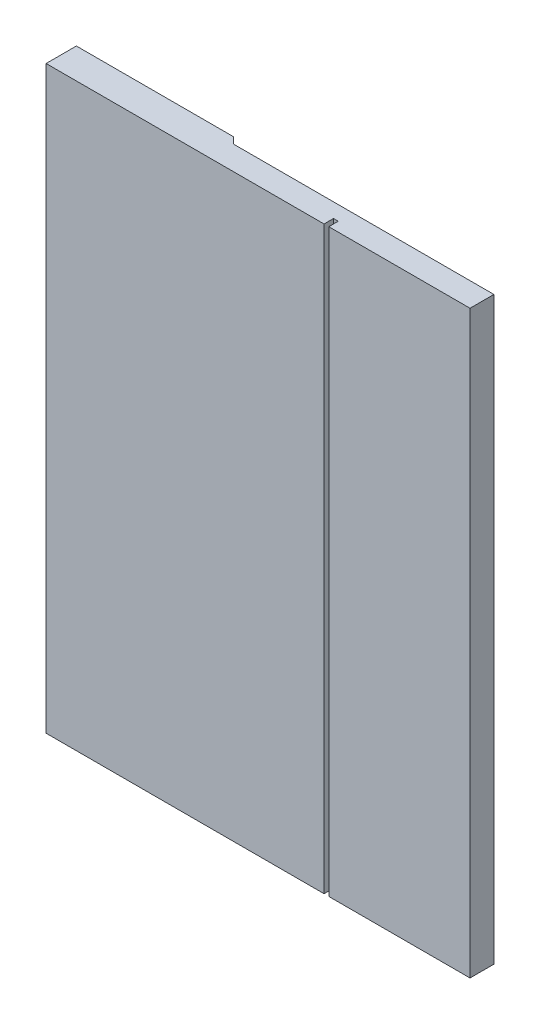
ISO-10303-21;
HEADER;
FILE_DESCRIPTION(('STEP AP214'),'2;1');
FILE_NAME('part.step','',(''),(''),'','','');
FILE_SCHEMA(('AUTOMOTIVE_DESIGN { 1 0 10303 214 1 1 1 1 }'));
ENDSEC;
DATA;
#1=APPLICATION_CONTEXT('core data for automotive mechanical design processes');
#2=APPLICATION_PROTOCOL_DEFINITION('international standard','automotive_design',2000,#1);
#3=PRODUCT_CONTEXT('',#1,'mechanical');
#4=PRODUCT('Part','Part','',(#3));
#5=PRODUCT_RELATED_PRODUCT_CATEGORY('part','',(#4));
#6=PRODUCT_DEFINITION_FORMATION('','',#4);
#7=PRODUCT_DEFINITION_CONTEXT('part definition',#1,'design');
#8=PRODUCT_DEFINITION('design','',#6,#7);
#9=PRODUCT_DEFINITION_SHAPE('','',#8);
#10=(LENGTH_UNIT() NAMED_UNIT(*) SI_UNIT(.MILLI.,.METRE.));
#11=(NAMED_UNIT(*) PLANE_ANGLE_UNIT() SI_UNIT($,.RADIAN.));
#12=(NAMED_UNIT(*) SI_UNIT($,.STERADIAN.) SOLID_ANGLE_UNIT());
#13=UNCERTAINTY_MEASURE_WITH_UNIT(LENGTH_MEASURE(1.E-05),#10,'distance_accuracy_value','');
#14=(GEOMETRIC_REPRESENTATION_CONTEXT(3) GLOBAL_UNCERTAINTY_ASSIGNED_CONTEXT((#13)) GLOBAL_UNIT_ASSIGNED_CONTEXT((#10,
#11,#12)) REPRESENTATION_CONTEXT('',''));
#15=CARTESIAN_POINT('',(0.,0.,0.));
#16=DIRECTION('',(0.,0.,1.));
#17=DIRECTION('',(1.,0.,0.));
#18=AXIS2_PLACEMENT_3D('',#15,#16,#17);
#19=CARTESIAN_POINT('',(0.,122.6,0.));
#20=DIRECTION('',(0.,0.,-1.));
#21=DIRECTION('',(-1.,0.,0.));
#22=AXIS2_PLACEMENT_3D('',#19,#20,#21);
#23=PLANE('',#22);
#24=DIRECTION('',(0.,-1.,0.));
#25=VECTOR('',#24,1.);
#26=CARTESIAN_POINT('',(-1.40000000000003,122.6,0.));
#27=LINE('',#26,#25);
#28=CARTESIAN_POINT('',(-1.40000000000003,122.6,0.));
#29=VERTEX_POINT('',#28);
#30=CARTESIAN_POINT('',(-1.39999999999999,0.,0.));
#31=VERTEX_POINT('',#30);
#32=EDGE_CURVE('E146',#29,#31,#27,.T.);
#33=ORIENTED_EDGE('',*,*,#32,.F.);
#34=DIRECTION('',(1.,0.,0.));
#35=VECTOR('',#34,1.);
#36=CARTESIAN_POINT('',(0.,122.6,0.));
#37=LINE('',#36,#35);
#38=CARTESIAN_POINT('',(-31.25,122.6,0.));
#39=VERTEX_POINT('',#38);
#40=EDGE_CURVE('E173',#39,#29,#37,.T.);
#41=ORIENTED_EDGE('',*,*,#40,.F.);
#42=DIRECTION('',(0.,-1.,0.));
#43=VECTOR('',#42,1.);
#44=CARTESIAN_POINT('',(-31.25,122.6,0.));
#45=LINE('',#44,#43);
#46=CARTESIAN_POINT('',(-31.25,0.,0.));
#47=VERTEX_POINT('',#46);
#48=EDGE_CURVE('E176',#39,#47,#45,.T.);
#49=ORIENTED_EDGE('',*,*,#48,.T.);
#50=DIRECTION('',(1.,0.,0.));
#51=VECTOR('',#50,1.);
#52=CARTESIAN_POINT('',(0.,0.,0.));
#53=LINE('',#52,#51);
#54=EDGE_CURVE('E155',#47,#31,#53,.T.);
#55=ORIENTED_EDGE('',*,*,#54,.T.);
#56=EDGE_LOOP('',(#33,#41,#49,#55));
#57=FACE_BOUND('',#56,.T.);
#58=ADVANCED_FACE('F44',(#57),#23,.F.);
#59=CARTESIAN_POINT('',(0.,122.6,0.));
#60=DIRECTION('',(0.,1.,0.));
#61=DIRECTION('',(0.,0.,1.));
#62=AXIS2_PLACEMENT_3D('',#59,#60,#61);
#63=PLANE('',#62);
#64=DIRECTION('',(0.,0.,-1.));
#65=VECTOR('',#64,1.);
#66=CARTESIAN_POINT('',(-1.40000000000003,122.6,0.));
#67=LINE('',#66,#65);
#68=CARTESIAN_POINT('',(-1.4,122.6,-5.05));
#69=VERTEX_POINT('',#68);
#70=EDGE_CURVE('E128',#29,#69,#67,.T.);
#71=ORIENTED_EDGE('',*,*,#70,.T.);
#72=DIRECTION('',(-1.,0.,0.));
#73=VECTOR('',#72,1.);
#74=CARTESIAN_POINT('',(-4.75,122.6,-5.05));
#75=LINE('',#74,#73);
#76=CARTESIAN_POINT('',(-56.4,122.6,-5.04999999999999));
#77=VERTEX_POINT('',#76);
#78=EDGE_CURVE('E67',#69,#77,#75,.T.);
#79=ORIENTED_EDGE('',*,*,#78,.T.);
#80=DIRECTION('',(0.707106781186546,0.,0.707106781186549));
#81=VECTOR('',#80,1.);
#82=CARTESIAN_POINT('',(-25.6750000000001,122.6,25.675));
#83=LINE('',#82,#81);
#84=CARTESIAN_POINT('',(-57.75,122.6,-6.39999999999999));
#85=VERTEX_POINT('',#84);
#86=EDGE_CURVE('E133',#85,#77,#83,.T.);
#87=ORIENTED_EDGE('',*,*,#86,.F.);
#88=DIRECTION('',(-1.,0.,0.));
#89=VECTOR('',#88,1.);
#90=CARTESIAN_POINT('',(-14.75,122.6,-6.4));
#91=LINE('',#90,#89);
#92=CARTESIAN_POINT('',(-91.,122.6,-6.39999999999999));
#93=VERTEX_POINT('',#92);
#94=EDGE_CURVE('E154',#85,#93,#91,.T.);
#95=ORIENTED_EDGE('',*,*,#94,.T.);
#96=DIRECTION('',(0.,0.,1.));
#97=VECTOR('',#96,1.);
#98=CARTESIAN_POINT('',(-91.,122.6,0.));
#99=LINE('',#98,#97);
#100=CARTESIAN_POINT('',(-91.,122.6,0.));
#101=VERTEX_POINT('',#100);
#102=EDGE_CURVE('E158',#93,#101,#99,.T.);
#103=ORIENTED_EDGE('',*,*,#102,.T.);
#104=DIRECTION('',(1.,0.,0.));
#105=VECTOR('',#104,1.);
#106=CARTESIAN_POINT('',(-32.25,122.6,0.));
#107=LINE('',#106,#105);
#108=CARTESIAN_POINT('',(-32.25,122.6,0.));
#109=VERTEX_POINT('',#108);
#110=EDGE_CURVE('E161',#101,#109,#107,.T.);
#111=ORIENTED_EDGE('',*,*,#110,.T.);
#112=DIRECTION('',(0.,0.,-1.));
#113=VECTOR('',#112,1.);
#114=CARTESIAN_POINT('',(-32.25,122.6,0.));
#115=LINE('',#114,#113);
#116=CARTESIAN_POINT('',(-32.25,122.6,-2.));
#117=VERTEX_POINT('',#116);
#118=EDGE_CURVE('E164',#109,#117,#115,.T.);
#119=ORIENTED_EDGE('',*,*,#118,.T.);
#120=DIRECTION('',(1.,0.,0.));
#121=VECTOR('',#120,1.);
#122=CARTESIAN_POINT('',(-32.25,122.6,-2.));
#123=LINE('',#122,#121);
#124=CARTESIAN_POINT('',(-31.25,122.6,-2.));
#125=VERTEX_POINT('',#124);
#126=EDGE_CURVE('E167',#117,#125,#123,.T.);
#127=ORIENTED_EDGE('',*,*,#126,.T.);
#128=DIRECTION('',(0.,0.,1.));
#129=VECTOR('',#128,1.);
#130=CARTESIAN_POINT('',(-31.25,122.6,-2.));
#131=LINE('',#130,#129);
#132=EDGE_CURVE('E170',#125,#39,#131,.T.);
#133=ORIENTED_EDGE('',*,*,#132,.T.);
#134=ORIENTED_EDGE('',*,*,#40,.T.);
#135=EDGE_LOOP('',(#71,#79,#87,#95,#103,#111,#119,#127,#133,#134));
#136=FACE_BOUND('',#135,.T.);
#137=ADVANCED_FACE('F256',(#136),#63,.T.);
#138=CARTESIAN_POINT('',(0.,0.,0.));
#139=DIRECTION('',(0.,1.,0.));
#140=DIRECTION('',(0.,0.,1.));
#141=AXIS2_PLACEMENT_3D('',#138,#139,#140);
#142=PLANE('',#141);
#143=DIRECTION('',(-1.,0.,0.));
#144=VECTOR('',#143,1.);
#145=CARTESIAN_POINT('',(-4.75,0.,-5.05));
#146=LINE('',#145,#144);
#147=CARTESIAN_POINT('',(-1.40000000000003,0.,-5.05));
#148=VERTEX_POINT('',#147);
#149=CARTESIAN_POINT('',(-56.4,0.,-5.04999999999999));
#150=VERTEX_POINT('',#149);
#151=EDGE_CURVE('E120',#148,#150,#146,.T.);
#152=ORIENTED_EDGE('',*,*,#151,.F.);
#153=DIRECTION('',(0.,0.,-1.));
#154=VECTOR('',#153,1.);
#155=CARTESIAN_POINT('',(-1.40000000000003,0.,0.));
#156=LINE('',#155,#154);
#157=EDGE_CURVE('E53',#31,#148,#156,.T.);
#158=ORIENTED_EDGE('',*,*,#157,.F.);
#159=ORIENTED_EDGE('',*,*,#54,.F.);
#160=DIRECTION('',(0.,0.,1.));
#161=VECTOR('',#160,1.);
#162=CARTESIAN_POINT('',(-31.25,0.,-2.));
#163=LINE('',#162,#161);
#164=CARTESIAN_POINT('',(-31.25,0.,-2.));
#165=VERTEX_POINT('',#164);
#166=EDGE_CURVE('E192',#165,#47,#163,.T.);
#167=ORIENTED_EDGE('',*,*,#166,.F.);
#168=DIRECTION('',(1.,0.,0.));
#169=VECTOR('',#168,1.);
#170=CARTESIAN_POINT('',(-32.25,0.,-2.));
#171=LINE('',#170,#169);
#172=CARTESIAN_POINT('',(-32.25,0.,-2.));
#173=VERTEX_POINT('',#172);
#174=EDGE_CURVE('E189',#173,#165,#171,.T.);
#175=ORIENTED_EDGE('',*,*,#174,.F.);
#176=DIRECTION('',(0.,0.,-1.));
#177=VECTOR('',#176,1.);
#178=CARTESIAN_POINT('',(-32.25,0.,0.));
#179=LINE('',#178,#177);
#180=CARTESIAN_POINT('',(-32.25,0.,0.));
#181=VERTEX_POINT('',#180);
#182=EDGE_CURVE('E186',#181,#173,#179,.T.);
#183=ORIENTED_EDGE('',*,*,#182,.F.);
#184=DIRECTION('',(1.,0.,0.));
#185=VECTOR('',#184,1.);
#186=CARTESIAN_POINT('',(-32.25,0.,0.));
#187=LINE('',#186,#185);
#188=CARTESIAN_POINT('',(-91.,0.,0.));
#189=VERTEX_POINT('',#188);
#190=EDGE_CURVE('E183',#189,#181,#187,.T.);
#191=ORIENTED_EDGE('',*,*,#190,.F.);
#192=DIRECTION('',(0.,0.,1.));
#193=VECTOR('',#192,1.);
#194=CARTESIAN_POINT('',(-91.,0.,0.));
#195=LINE('',#194,#193);
#196=CARTESIAN_POINT('',(-91.,0.,-6.39999999999999));
#197=VERTEX_POINT('',#196);
#198=EDGE_CURVE('E180',#197,#189,#195,.T.);
#199=ORIENTED_EDGE('',*,*,#198,.F.);
#200=DIRECTION('',(-1.,0.,0.));
#201=VECTOR('',#200,1.);
#202=CARTESIAN_POINT('',(-14.75,0.,-6.4));
#203=LINE('',#202,#201);
#204=CARTESIAN_POINT('',(-57.75,0.,-6.39999999999999));
#205=VERTEX_POINT('',#204);
#206=EDGE_CURVE('E127',#205,#197,#203,.T.);
#207=ORIENTED_EDGE('',*,*,#206,.F.);
#208=DIRECTION('',(0.707106781186546,0.,0.707106781186549));
#209=VECTOR('',#208,1.);
#210=CARTESIAN_POINT('',(-56.4,0.,-5.04999999999999));
#211=LINE('',#210,#209);
#212=EDGE_CURVE('E60',#205,#150,#211,.T.);
#213=ORIENTED_EDGE('',*,*,#212,.T.);
#214=EDGE_LOOP('',(#152,#158,#159,#167,#175,#183,#191,#199,#207,#213));
#215=FACE_BOUND('',#214,.T.);
#216=ADVANCED_FACE('F137',(#215),#142,.F.);
#217=CARTESIAN_POINT('',(-4.75,122.6,-5.05));
#218=DIRECTION('',(0.,0.,1.));
#219=DIRECTION('',(1.,0.,0.));
#220=AXIS2_PLACEMENT_3D('',#217,#218,#219);
#221=PLANE('',#220);
#222=ORIENTED_EDGE('',*,*,#151,.T.);
#223=DIRECTION('',(0.,1.,0.));
#224=VECTOR('',#223,1.);
#225=CARTESIAN_POINT('',(-56.4,0.,-5.04999999999999));
#226=LINE('',#225,#224);
#227=EDGE_CURVE('E121',#150,#77,#226,.T.);
#228=ORIENTED_EDGE('',*,*,#227,.T.);
#229=ORIENTED_EDGE('',*,*,#78,.F.);
#230=DIRECTION('',(0.,1.,0.));
#231=VECTOR('',#230,1.);
#232=CARTESIAN_POINT('',(-1.40000000000003,0.,-5.05));
#233=LINE('',#232,#231);
#234=EDGE_CURVE('E122',#148,#69,#233,.T.);
#235=ORIENTED_EDGE('',*,*,#234,.F.);
#236=EDGE_LOOP('',(#222,#228,#229,#235));
#237=FACE_BOUND('',#236,.T.);
#238=ADVANCED_FACE('F46',(#237),#221,.F.);
#239=CARTESIAN_POINT('',(-14.75,122.6,-6.4));
#240=DIRECTION('',(0.,0.,1.));
#241=DIRECTION('',(1.,0.,0.));
#242=AXIS2_PLACEMENT_3D('',#239,#240,#241);
#243=PLANE('',#242);
#244=ORIENTED_EDGE('',*,*,#94,.F.);
#245=DIRECTION('',(0.,-1.,0.));
#246=VECTOR('',#245,1.);
#247=CARTESIAN_POINT('',(-57.75,122.6,-6.39999999999999));
#248=LINE('',#247,#246);
#249=EDGE_CURVE('E12',#85,#205,#248,.T.);
#250=ORIENTED_EDGE('',*,*,#249,.T.);
#251=ORIENTED_EDGE('',*,*,#206,.T.);
#252=DIRECTION('',(0.,-1.,0.));
#253=VECTOR('',#252,1.);
#254=CARTESIAN_POINT('',(-91.,122.6,-6.39999999999999));
#255=LINE('',#254,#253);
#256=EDGE_CURVE('E217',#93,#197,#255,.T.);
#257=ORIENTED_EDGE('',*,*,#256,.F.);
#258=EDGE_LOOP('',(#244,#250,#251,#257));
#259=FACE_BOUND('',#258,.T.);
#260=ADVANCED_FACE('F254',(#259),#243,.F.);
#261=CARTESIAN_POINT('',(-91.,122.6,0.));
#262=DIRECTION('',(1.,0.,0.));
#263=DIRECTION('',(0.,0.,-1.));
#264=AXIS2_PLACEMENT_3D('',#261,#262,#263);
#265=PLANE('',#264);
#266=ORIENTED_EDGE('',*,*,#198,.T.);
#267=DIRECTION('',(0.,-1.,0.));
#268=VECTOR('',#267,1.);
#269=CARTESIAN_POINT('',(-91.,122.6,0.));
#270=LINE('',#269,#268);
#271=EDGE_CURVE('E213',#101,#189,#270,.T.);
#272=ORIENTED_EDGE('',*,*,#271,.F.);
#273=ORIENTED_EDGE('',*,*,#102,.F.);
#274=ORIENTED_EDGE('',*,*,#256,.T.);
#275=EDGE_LOOP('',(#266,#272,#273,#274));
#276=FACE_BOUND('',#275,.T.);
#277=ADVANCED_FACE('F249',(#276),#265,.F.);
#278=CARTESIAN_POINT('',(-32.25,122.6,0.));
#279=DIRECTION('',(0.,0.,-1.));
#280=DIRECTION('',(-1.,0.,0.));
#281=AXIS2_PLACEMENT_3D('',#278,#279,#280);
#282=PLANE('',#281);
#283=ORIENTED_EDGE('',*,*,#190,.T.);
#284=DIRECTION('',(0.,-1.,0.));
#285=VECTOR('',#284,1.);
#286=CARTESIAN_POINT('',(-32.25,122.6,0.));
#287=LINE('',#286,#285);
#288=EDGE_CURVE('E209',#109,#181,#287,.T.);
#289=ORIENTED_EDGE('',*,*,#288,.F.);
#290=ORIENTED_EDGE('',*,*,#110,.F.);
#291=ORIENTED_EDGE('',*,*,#271,.T.);
#292=EDGE_LOOP('',(#283,#289,#290,#291));
#293=FACE_BOUND('',#292,.T.);
#294=ADVANCED_FACE('F246',(#293),#282,.F.);
#295=CARTESIAN_POINT('',(-32.25,122.6,0.));
#296=DIRECTION('',(-1.,0.,0.));
#297=DIRECTION('',(0.,0.,1.));
#298=AXIS2_PLACEMENT_3D('',#295,#296,#297);
#299=PLANE('',#298);
#300=ORIENTED_EDGE('',*,*,#182,.T.);
#301=DIRECTION('',(0.,-1.,0.));
#302=VECTOR('',#301,1.);
#303=CARTESIAN_POINT('',(-32.25,122.6,-2.));
#304=LINE('',#303,#302);
#305=EDGE_CURVE('E205',#117,#173,#304,.T.);
#306=ORIENTED_EDGE('',*,*,#305,.F.);
#307=ORIENTED_EDGE('',*,*,#118,.F.);
#308=ORIENTED_EDGE('',*,*,#288,.T.);
#309=EDGE_LOOP('',(#300,#306,#307,#308));
#310=FACE_BOUND('',#309,.T.);
#311=ADVANCED_FACE('F242',(#310),#299,.F.);
#312=CARTESIAN_POINT('',(-32.25,122.6,-2.));
#313=DIRECTION('',(0.,0.,-1.));
#314=DIRECTION('',(-1.,0.,0.));
#315=AXIS2_PLACEMENT_3D('',#312,#313,#314);
#316=PLANE('',#315);
#317=ORIENTED_EDGE('',*,*,#174,.T.);
#318=DIRECTION('',(0.,-1.,0.));
#319=VECTOR('',#318,1.);
#320=CARTESIAN_POINT('',(-31.25,122.6,-2.));
#321=LINE('',#320,#319);
#322=EDGE_CURVE('E201',#125,#165,#321,.T.);
#323=ORIENTED_EDGE('',*,*,#322,.F.);
#324=ORIENTED_EDGE('',*,*,#126,.F.);
#325=ORIENTED_EDGE('',*,*,#305,.T.);
#326=EDGE_LOOP('',(#317,#323,#324,#325));
#327=FACE_BOUND('',#326,.T.);
#328=ADVANCED_FACE('F237',(#327),#316,.F.);
#329=CARTESIAN_POINT('',(-31.25,122.6,-2.));
#330=DIRECTION('',(1.,0.,0.));
#331=DIRECTION('',(0.,0.,-1.));
#332=AXIS2_PLACEMENT_3D('',#329,#330,#331);
#333=PLANE('',#332);
#334=ORIENTED_EDGE('',*,*,#166,.T.);
#335=ORIENTED_EDGE('',*,*,#48,.F.);
#336=ORIENTED_EDGE('',*,*,#132,.F.);
#337=ORIENTED_EDGE('',*,*,#322,.T.);
#338=EDGE_LOOP('',(#334,#335,#336,#337));
#339=FACE_BOUND('',#338,.T.);
#340=ADVANCED_FACE('F231',(#339),#333,.F.);
#341=CARTESIAN_POINT('',(-1.40000000000003,122.6,3.88578058618805E-13));
#342=DIRECTION('',(1.,0.,0.));
#343=DIRECTION('',(0.,0.,-1.));
#344=AXIS2_PLACEMENT_3D('',#341,#342,#343);
#345=PLANE('',#344);
#346=ORIENTED_EDGE('',*,*,#234,.T.);
#347=ORIENTED_EDGE('',*,*,#70,.F.);
#348=ORIENTED_EDGE('',*,*,#32,.T.);
#349=ORIENTED_EDGE('',*,*,#157,.T.);
#350=EDGE_LOOP('',(#346,#347,#348,#349));
#351=FACE_BOUND('',#350,.T.);
#352=ADVANCED_FACE('F222',(#351),#345,.T.);
#353=CARTESIAN_POINT('',(-56.4,0.,-5.04999999999999));
#354=DIRECTION('',(-0.707106781186549,0.,0.707106781186546));
#355=DIRECTION('',(0.707106781186546,0.,0.707106781186549));
#356=AXIS2_PLACEMENT_3D('',#353,#354,#355);
#357=PLANE('',#356);
#358=ORIENTED_EDGE('',*,*,#86,.T.);
#359=ORIENTED_EDGE('',*,*,#227,.F.);
#360=ORIENTED_EDGE('',*,*,#212,.F.);
#361=ORIENTED_EDGE('',*,*,#249,.F.);
#362=EDGE_LOOP('',(#358,#359,#360,#361));
#363=FACE_BOUND('',#362,.T.);
#364=ADVANCED_FACE('F131',(#363),#357,.F.);
#365=CLOSED_SHELL('',(#58,#137,#216,#238,#260,#277,#294,#311,#328,#340,#352,#364));
#366=MANIFOLD_SOLID_BREP('B2',#365);
#367=ADVANCED_BREP_SHAPE_REPRESENTATION('',(#18,#366),#14);
#368=SHAPE_DEFINITION_REPRESENTATION(#9,#367);
ENDSEC;
END-ISO-10303-21;
